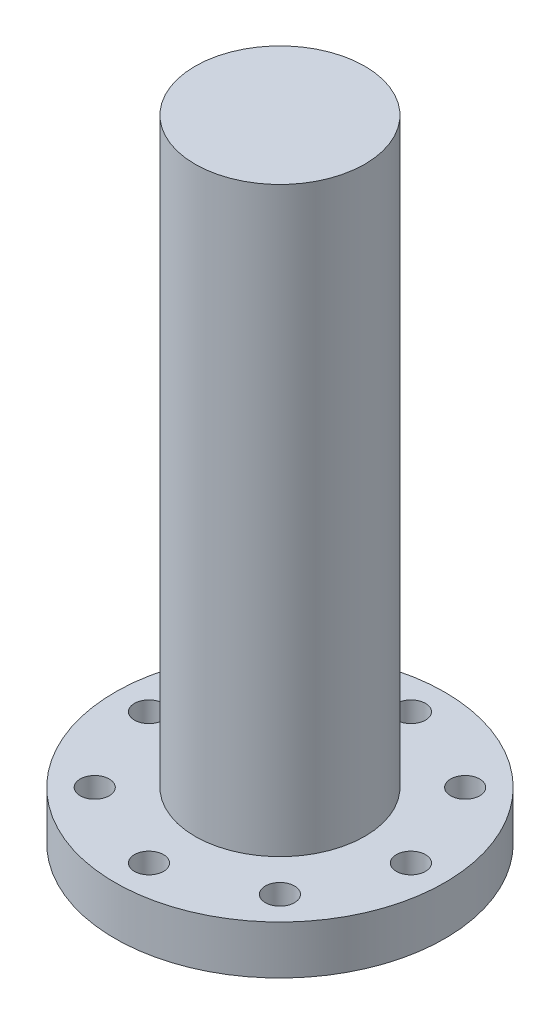
ISO-10303-21;
HEADER;
FILE_DESCRIPTION(('STEP AP214'),'2;1');
FILE_NAME('part.step','',(''),(''),'','','');
FILE_SCHEMA(('AUTOMOTIVE_DESIGN { 1 0 10303 214 1 1 1 1 }'));
ENDSEC;
DATA;
#1=APPLICATION_CONTEXT('core data for automotive mechanical design processes');
#2=APPLICATION_PROTOCOL_DEFINITION('international standard','automotive_design',2000,#1);
#3=PRODUCT_CONTEXT('',#1,'mechanical');
#4=PRODUCT('Part','Part','',(#3));
#5=PRODUCT_RELATED_PRODUCT_CATEGORY('part','',(#4));
#6=PRODUCT_DEFINITION_FORMATION('','',#4);
#7=PRODUCT_DEFINITION_CONTEXT('part definition',#1,'design');
#8=PRODUCT_DEFINITION('design','',#6,#7);
#9=PRODUCT_DEFINITION_SHAPE('','',#8);
#10=(LENGTH_UNIT() NAMED_UNIT(*) SI_UNIT(.MILLI.,.METRE.));
#11=(NAMED_UNIT(*) PLANE_ANGLE_UNIT() SI_UNIT($,.RADIAN.));
#12=(NAMED_UNIT(*) SI_UNIT($,.STERADIAN.) SOLID_ANGLE_UNIT());
#13=UNCERTAINTY_MEASURE_WITH_UNIT(LENGTH_MEASURE(1.E-05),#10,'distance_accuracy_value','');
#14=(GEOMETRIC_REPRESENTATION_CONTEXT(3) GLOBAL_UNCERTAINTY_ASSIGNED_CONTEXT((#13)) GLOBAL_UNIT_ASSIGNED_CONTEXT((#10,
#11,#12)) REPRESENTATION_CONTEXT('',''));
#15=CARTESIAN_POINT('',(0.,0.,0.));
#16=DIRECTION('',(0.,0.,1.));
#17=DIRECTION('',(1.,0.,0.));
#18=AXIS2_PLACEMENT_3D('',#15,#16,#17);
#19=CARTESIAN_POINT('',(0.,0.,0.));
#20=DIRECTION('',(0.,-1.,0.));
#21=DIRECTION('',(0.,0.,-1.));
#22=AXIS2_PLACEMENT_3D('',#19,#20,#21);
#23=PLANE('',#22);
#24=CARTESIAN_POINT('',(27.0000000000011,0.,1.14611941239482E-12));
#25=DIRECTION('',(0.,-1.,0.));
#26=DIRECTION('',(0.,0.,-1.));
#27=AXIS2_PLACEMENT_3D('',#24,#25,#26);
#28=CIRCLE('',#27,3.00000000000085);
#29=CARTESIAN_POINT('',(27.0000000000011,0.,-2.9999999999997));
#30=VERTEX_POINT('',#29);
#31=EDGE_CURVE('E51',#30,#30,#28,.T.);
#32=ORIENTED_EDGE('',*,*,#31,.F.);
#33=EDGE_LOOP('',(#32));
#34=FACE_BOUND('',#33,.T.);
#35=CARTESIAN_POINT('',(19.0918830920387,0.,-19.091883092036));
#36=DIRECTION('',(0.,-1.,0.));
#37=DIRECTION('',(0.,0.,-1.));
#38=AXIS2_PLACEMENT_3D('',#35,#36,#37);
#39=CIRCLE('',#38,3.00000000000177);
#40=CARTESIAN_POINT('',(19.0918830920387,0.,-22.0918830920377));
#41=VERTEX_POINT('',#40);
#42=EDGE_CURVE('E97',#41,#41,#39,.T.);
#43=ORIENTED_EDGE('',*,*,#42,.F.);
#44=EDGE_LOOP('',(#43));
#45=FACE_BOUND('',#44,.T.);
#46=CARTESIAN_POINT('',(2.29223882478963E-12,0.,-27.));
#47=DIRECTION('',(0.,-1.,0.));
#48=DIRECTION('',(0.,0.,-1.));
#49=AXIS2_PLACEMENT_3D('',#46,#47,#48);
#50=CIRCLE('',#49,3.00000000000237);
#51=CARTESIAN_POINT('',(2.29223882478963E-12,0.,-30.0000000000024));
#52=VERTEX_POINT('',#51);
#53=EDGE_CURVE('E94',#52,#52,#50,.T.);
#54=ORIENTED_EDGE('',*,*,#53,.F.);
#55=EDGE_LOOP('',(#54));
#56=FACE_BOUND('',#55,.T.);
#57=CARTESIAN_POINT('',(-19.0918830920348,0.,-19.0918830920376));
#58=DIRECTION('',(0.,-1.,0.));
#59=DIRECTION('',(0.,0.,-1.));
#60=AXIS2_PLACEMENT_3D('',#57,#58,#59);
#61=CIRCLE('',#60,3.00000000000233);
#62=CARTESIAN_POINT('',(-19.0918830920348,0.,-22.0918830920399));
#63=VERTEX_POINT('',#62);
#64=EDGE_CURVE('E91',#63,#63,#61,.T.);
#65=ORIENTED_EDGE('',*,*,#64,.F.);
#66=EDGE_LOOP('',(#65));
#67=FACE_BOUND('',#66,.T.);
#68=CARTESIAN_POINT('',(-26.9999999999989,0.,-1.14942595875251E-12));
#69=DIRECTION('',(0.,-1.,0.));
#70=DIRECTION('',(0.,0.,-1.));
#71=AXIS2_PLACEMENT_3D('',#68,#69,#70);
#72=CIRCLE('',#71,3.0000000000017);
#73=CARTESIAN_POINT('',(-26.9999999999989,0.,-3.00000000000285));
#74=VERTEX_POINT('',#73);
#75=EDGE_CURVE('E88',#74,#74,#72,.T.);
#76=ORIENTED_EDGE('',*,*,#75,.F.);
#77=EDGE_LOOP('',(#76));
#78=FACE_BOUND('',#77,.T.);
#79=CARTESIAN_POINT('',(-19.0918830920365,0.,19.091883092036));
#80=DIRECTION('',(0.,-1.,0.));
#81=DIRECTION('',(0.,0.,-1.));
#82=AXIS2_PLACEMENT_3D('',#79,#80,#81);
#83=CIRCLE('',#82,3.00000000000087);
#84=CARTESIAN_POINT('',(-19.0918830920365,0.,16.0918830920351));
#85=VERTEX_POINT('',#84);
#86=EDGE_CURVE('E85',#85,#85,#83,.T.);
#87=ORIENTED_EDGE('',*,*,#86,.F.);
#88=EDGE_LOOP('',(#87));
#89=FACE_BOUND('',#88,.T.);
#90=CARTESIAN_POINT('',(0.,0.,27.));
#91=DIRECTION('',(0.,-1.,0.));
#92=DIRECTION('',(0.,0.,-1.));
#93=AXIS2_PLACEMENT_3D('',#90,#91,#92);
#94=CIRCLE('',#93,3.);
#95=CARTESIAN_POINT('',(0.,0.,24.));
#96=VERTEX_POINT('',#95);
#97=EDGE_CURVE('E82',#96,#96,#94,.T.);
#98=ORIENTED_EDGE('',*,*,#97,.F.);
#99=EDGE_LOOP('',(#98));
#100=FACE_BOUND('',#99,.T.);
#101=CARTESIAN_POINT('',(19.0918830920371,0.,19.0918830920376));
#102=DIRECTION('',(0.,-1.,0.));
#103=DIRECTION('',(0.,0.,-1.));
#104=AXIS2_PLACEMENT_3D('',#101,#102,#103);
#105=CIRCLE('',#104,3.00000000000013);
#106=CARTESIAN_POINT('',(19.0918830920371,0.,16.0918830920375));
#107=VERTEX_POINT('',#106);
#108=EDGE_CURVE('E79',#107,#107,#105,.T.);
#109=ORIENTED_EDGE('',*,*,#108,.F.);
#110=EDGE_LOOP('',(#109));
#111=FACE_BOUND('',#110,.T.);
#112=CARTESIAN_POINT('',(0.,0.,0.));
#113=DIRECTION('',(0.,-1.,0.));
#114=DIRECTION('',(0.,0.,-1.));
#115=AXIS2_PLACEMENT_3D('',#112,#113,#114);
#116=CIRCLE('',#115,34.);
#117=CARTESIAN_POINT('',(0.,0.,-34.));
#118=VERTEX_POINT('',#117);
#119=EDGE_CURVE('E10',#118,#118,#116,.T.);
#120=ORIENTED_EDGE('',*,*,#119,.T.);
#121=EDGE_LOOP('',(#120));
#122=FACE_BOUND('',#121,.T.);
#123=ADVANCED_FACE('F31',(#34,#45,#56,#67,#78,#89,#100,#111,#122),#23,.T.);
#124=CARTESIAN_POINT('',(0.,0.,0.));
#125=DIRECTION('',(0.,-1.,0.));
#126=DIRECTION('',(0.,0.,-1.));
#127=AXIS2_PLACEMENT_3D('',#124,#125,#126);
#128=CYLINDRICAL_SURFACE('',#127,34.);
#129=CARTESIAN_POINT('',(0.,10.,0.));
#130=DIRECTION('',(0.,-1.,0.));
#131=DIRECTION('',(0.,0.,-1.));
#132=AXIS2_PLACEMENT_3D('',#129,#130,#131);
#133=CIRCLE('',#132,34.);
#134=CARTESIAN_POINT('',(0.,10.,-34.));
#135=VERTEX_POINT('',#134);
#136=EDGE_CURVE('E38',#135,#135,#133,.T.);
#137=ORIENTED_EDGE('',*,*,#136,.T.);
#138=EDGE_LOOP('',(#137));
#139=FACE_BOUND('',#138,.T.);
#140=ORIENTED_EDGE('',*,*,#119,.F.);
#141=EDGE_LOOP('',(#140));
#142=FACE_BOUND('',#141,.T.);
#143=ADVANCED_FACE('F107',(#139,#142),#128,.T.);
#144=CARTESIAN_POINT('',(0.,10.,-34.));
#145=DIRECTION('',(0.,1.,0.));
#146=DIRECTION('',(0.,0.,1.));
#147=AXIS2_PLACEMENT_3D('',#144,#145,#146);
#148=PLANE('',#147);
#149=CARTESIAN_POINT('',(27.0000000000011,9.99999999999999,1.14611941239482E-12));
#150=DIRECTION('',(0.,1.,0.));
#151=DIRECTION('',(0.,0.,1.));
#152=AXIS2_PLACEMENT_3D('',#149,#150,#151);
#153=CIRCLE('',#152,3.00000000000085);
#154=CARTESIAN_POINT('',(27.0000000000011,9.99999999999999,3.000000000002));
#155=VERTEX_POINT('',#154);
#156=EDGE_CURVE('E34',#155,#155,#153,.T.);
#157=ORIENTED_EDGE('',*,*,#156,.F.);
#158=EDGE_LOOP('',(#157));
#159=FACE_BOUND('',#158,.T.);
#160=CARTESIAN_POINT('',(19.0918830920387,9.99999999999999,-19.091883092036));
#161=DIRECTION('',(0.,1.,0.));
#162=DIRECTION('',(0.,0.,1.));
#163=AXIS2_PLACEMENT_3D('',#160,#161,#162);
#164=CIRCLE('',#163,3.00000000000177);
#165=CARTESIAN_POINT('',(19.0918830920387,9.99999999999999,-16.0918830920342));
#166=VERTEX_POINT('',#165);
#167=EDGE_CURVE('E65',#166,#166,#164,.T.);
#168=ORIENTED_EDGE('',*,*,#167,.F.);
#169=EDGE_LOOP('',(#168));
#170=FACE_BOUND('',#169,.T.);
#171=CARTESIAN_POINT('',(2.29223882478963E-12,9.99999999999999,-27.));
#172=DIRECTION('',(0.,1.,0.));
#173=DIRECTION('',(0.,0.,1.));
#174=AXIS2_PLACEMENT_3D('',#171,#172,#173);
#175=CIRCLE('',#174,3.00000000000237);
#176=CARTESIAN_POINT('',(2.29223882478963E-12,9.99999999999999,-23.9999999999976));
#177=VERTEX_POINT('',#176);
#178=EDGE_CURVE('E63',#177,#177,#175,.T.);
#179=ORIENTED_EDGE('',*,*,#178,.F.);
#180=EDGE_LOOP('',(#179));
#181=FACE_BOUND('',#180,.T.);
#182=CARTESIAN_POINT('',(-19.0918830920348,9.99999999999999,-19.0918830920376));
#183=DIRECTION('',(0.,1.,0.));
#184=DIRECTION('',(0.,0.,1.));
#185=AXIS2_PLACEMENT_3D('',#182,#183,#184);
#186=CIRCLE('',#185,3.00000000000233);
#187=CARTESIAN_POINT('',(-19.0918830920348,9.99999999999999,-16.0918830920353));
#188=VERTEX_POINT('',#187);
#189=EDGE_CURVE('E60',#188,#188,#186,.T.);
#190=ORIENTED_EDGE('',*,*,#189,.F.);
#191=EDGE_LOOP('',(#190));
#192=FACE_BOUND('',#191,.T.);
#193=CARTESIAN_POINT('',(-26.9999999999989,9.99999999999999,-1.14942595875251E-12));
#194=DIRECTION('',(0.,1.,0.));
#195=DIRECTION('',(0.,0.,1.));
#196=AXIS2_PLACEMENT_3D('',#193,#194,#195);
#197=CIRCLE('',#196,3.0000000000017);
#198=CARTESIAN_POINT('',(-26.9999999999989,9.99999999999999,3.00000000000056));
#199=VERTEX_POINT('',#198);
#200=EDGE_CURVE('E57',#199,#199,#197,.T.);
#201=ORIENTED_EDGE('',*,*,#200,.F.);
#202=EDGE_LOOP('',(#201));
#203=FACE_BOUND('',#202,.T.);
#204=CARTESIAN_POINT('',(-19.0918830920365,9.99999999999999,19.091883092036));
#205=DIRECTION('',(0.,1.,0.));
#206=DIRECTION('',(0.,0.,1.));
#207=AXIS2_PLACEMENT_3D('',#204,#205,#206);
#208=CIRCLE('',#207,3.00000000000087);
#209=CARTESIAN_POINT('',(-19.0918830920365,9.99999999999999,22.0918830920368));
#210=VERTEX_POINT('',#209);
#211=EDGE_CURVE('E54',#210,#210,#208,.T.);
#212=ORIENTED_EDGE('',*,*,#211,.F.);
#213=EDGE_LOOP('',(#212));
#214=FACE_BOUND('',#213,.T.);
#215=CARTESIAN_POINT('',(0.,9.99999999999999,27.));
#216=DIRECTION('',(0.,1.,0.));
#217=DIRECTION('',(0.,0.,1.));
#218=AXIS2_PLACEMENT_3D('',#215,#216,#217);
#219=CIRCLE('',#218,3.);
#220=CARTESIAN_POINT('',(0.,9.99999999999999,30.));
#221=VERTEX_POINT('',#220);
#222=EDGE_CURVE('E50',#221,#221,#219,.T.);
#223=ORIENTED_EDGE('',*,*,#222,.F.);
#224=EDGE_LOOP('',(#223));
#225=FACE_BOUND('',#224,.T.);
#226=CARTESIAN_POINT('',(19.0918830920371,9.99999999999999,19.0918830920376));
#227=DIRECTION('',(0.,1.,0.));
#228=DIRECTION('',(0.,0.,1.));
#229=AXIS2_PLACEMENT_3D('',#226,#227,#228);
#230=CIRCLE('',#229,3.00000000000013);
#231=CARTESIAN_POINT('',(19.0918830920371,9.99999999999999,22.0918830920377));
#232=VERTEX_POINT('',#231);
#233=EDGE_CURVE('E47',#232,#232,#230,.T.);
#234=ORIENTED_EDGE('',*,*,#233,.F.);
#235=EDGE_LOOP('',(#234));
#236=FACE_BOUND('',#235,.T.);
#237=CARTESIAN_POINT('',(0.,10.,0.));
#238=DIRECTION('',(0.,-1.,0.));
#239=DIRECTION('',(0.,0.,-1.));
#240=AXIS2_PLACEMENT_3D('',#237,#238,#239);
#241=CIRCLE('',#240,17.5);
#242=CARTESIAN_POINT('',(0.,10.,-17.5));
#243=VERTEX_POINT('',#242);
#244=EDGE_CURVE('E43',#243,#243,#241,.T.);
#245=ORIENTED_EDGE('',*,*,#244,.T.);
#246=EDGE_LOOP('',(#245));
#247=FACE_BOUND('',#246,.T.);
#248=ORIENTED_EDGE('',*,*,#136,.F.);
#249=EDGE_LOOP('',(#248));
#250=FACE_BOUND('',#249,.T.);
#251=ADVANCED_FACE('F142',(#159,#170,#181,#192,#203,#214,#225,#236,#247,#250),#148,.T.);
#252=CARTESIAN_POINT('',(0.,0.,0.));
#253=DIRECTION('',(0.,-1.,0.));
#254=DIRECTION('',(0.,0.,-1.));
#255=AXIS2_PLACEMENT_3D('',#252,#253,#254);
#256=CYLINDRICAL_SURFACE('',#255,17.5);
#257=CARTESIAN_POINT('',(0.,130.,0.));
#258=DIRECTION('',(0.,-1.,0.));
#259=DIRECTION('',(0.,0.,-1.));
#260=AXIS2_PLACEMENT_3D('',#257,#258,#259);
#261=CIRCLE('',#260,17.5);
#262=CARTESIAN_POINT('',(0.,130.,-17.5));
#263=VERTEX_POINT('',#262);
#264=EDGE_CURVE('E70',#263,#263,#261,.T.);
#265=ORIENTED_EDGE('',*,*,#264,.T.);
#266=EDGE_LOOP('',(#265));
#267=FACE_BOUND('',#266,.T.);
#268=ORIENTED_EDGE('',*,*,#244,.F.);
#269=EDGE_LOOP('',(#268));
#270=FACE_BOUND('',#269,.T.);
#271=ADVANCED_FACE('F135',(#267,#270),#256,.T.);
#272=CARTESIAN_POINT('',(0.,130.,-17.5));
#273=DIRECTION('',(0.,1.,0.));
#274=DIRECTION('',(0.,0.,1.));
#275=AXIS2_PLACEMENT_3D('',#272,#273,#274);
#276=PLANE('',#275);
#277=ORIENTED_EDGE('',*,*,#264,.F.);
#278=EDGE_LOOP('',(#277));
#279=FACE_BOUND('',#278,.T.);
#280=ADVANCED_FACE('F125',(#279),#276,.T.);
#281=CARTESIAN_POINT('',(19.0918830920371,130.,19.0918830920376));
#282=DIRECTION('',(0.,-1.,0.));
#283=DIRECTION('',(0.,0.,-1.));
#284=AXIS2_PLACEMENT_3D('',#281,#282,#283);
#285=CYLINDRICAL_SURFACE('',#284,3.00000000000013);
#286=ORIENTED_EDGE('',*,*,#233,.T.);
#287=EDGE_LOOP('',(#286));
#288=FACE_BOUND('',#287,.T.);
#289=ORIENTED_EDGE('',*,*,#108,.T.);
#290=EDGE_LOOP('',(#289));
#291=FACE_BOUND('',#290,.T.);
#292=ADVANCED_FACE('F122',(#288,#291),#285,.F.);
#293=CARTESIAN_POINT('',(0.,130.,27.));
#294=DIRECTION('',(0.,-1.,0.));
#295=DIRECTION('',(0.,0.,-1.));
#296=AXIS2_PLACEMENT_3D('',#293,#294,#295);
#297=CYLINDRICAL_SURFACE('',#296,3.);
#298=ORIENTED_EDGE('',*,*,#222,.T.);
#299=EDGE_LOOP('',(#298));
#300=FACE_BOUND('',#299,.T.);
#301=ORIENTED_EDGE('',*,*,#97,.T.);
#302=EDGE_LOOP('',(#301));
#303=FACE_BOUND('',#302,.T.);
#304=ADVANCED_FACE('F124',(#300,#303),#297,.F.);
#305=CARTESIAN_POINT('',(-19.0918830920365,130.,19.091883092036));
#306=DIRECTION('',(0.,-1.,0.));
#307=DIRECTION('',(0.,0.,-1.));
#308=AXIS2_PLACEMENT_3D('',#305,#306,#307);
#309=CYLINDRICAL_SURFACE('',#308,3.00000000000087);
#310=ORIENTED_EDGE('',*,*,#211,.T.);
#311=EDGE_LOOP('',(#310));
#312=FACE_BOUND('',#311,.T.);
#313=ORIENTED_EDGE('',*,*,#86,.T.);
#314=EDGE_LOOP('',(#313));
#315=FACE_BOUND('',#314,.T.);
#316=ADVANCED_FACE('F132',(#312,#315),#309,.F.);
#317=CARTESIAN_POINT('',(-26.9999999999989,130.,-1.14942595875251E-12));
#318=DIRECTION('',(0.,-1.,0.));
#319=DIRECTION('',(0.,0.,-1.));
#320=AXIS2_PLACEMENT_3D('',#317,#318,#319);
#321=CYLINDRICAL_SURFACE('',#320,3.0000000000017);
#322=ORIENTED_EDGE('',*,*,#200,.T.);
#323=EDGE_LOOP('',(#322));
#324=FACE_BOUND('',#323,.T.);
#325=ORIENTED_EDGE('',*,*,#75,.T.);
#326=EDGE_LOOP('',(#325));
#327=FACE_BOUND('',#326,.T.);
#328=ADVANCED_FACE('F195',(#324,#327),#321,.F.);
#329=CARTESIAN_POINT('',(-19.0918830920348,130.,-19.0918830920376));
#330=DIRECTION('',(0.,-1.,0.));
#331=DIRECTION('',(0.,0.,-1.));
#332=AXIS2_PLACEMENT_3D('',#329,#330,#331);
#333=CYLINDRICAL_SURFACE('',#332,3.00000000000233);
#334=ORIENTED_EDGE('',*,*,#189,.T.);
#335=EDGE_LOOP('',(#334));
#336=FACE_BOUND('',#335,.T.);
#337=ORIENTED_EDGE('',*,*,#64,.T.);
#338=EDGE_LOOP('',(#337));
#339=FACE_BOUND('',#338,.T.);
#340=ADVANCED_FACE('F203',(#336,#339),#333,.F.);
#341=CARTESIAN_POINT('',(2.29223882478963E-12,130.,-27.));
#342=DIRECTION('',(0.,-1.,0.));
#343=DIRECTION('',(0.,0.,-1.));
#344=AXIS2_PLACEMENT_3D('',#341,#342,#343);
#345=CYLINDRICAL_SURFACE('',#344,3.00000000000237);
#346=ORIENTED_EDGE('',*,*,#178,.T.);
#347=EDGE_LOOP('',(#346));
#348=FACE_BOUND('',#347,.T.);
#349=ORIENTED_EDGE('',*,*,#53,.T.);
#350=EDGE_LOOP('',(#349));
#351=FACE_BOUND('',#350,.T.);
#352=ADVANCED_FACE('F212',(#348,#351),#345,.F.);
#353=CARTESIAN_POINT('',(19.0918830920387,130.,-19.091883092036));
#354=DIRECTION('',(0.,-1.,0.));
#355=DIRECTION('',(0.,0.,-1.));
#356=AXIS2_PLACEMENT_3D('',#353,#354,#355);
#357=CYLINDRICAL_SURFACE('',#356,3.00000000000177);
#358=ORIENTED_EDGE('',*,*,#167,.T.);
#359=EDGE_LOOP('',(#358));
#360=FACE_BOUND('',#359,.T.);
#361=ORIENTED_EDGE('',*,*,#42,.T.);
#362=EDGE_LOOP('',(#361));
#363=FACE_BOUND('',#362,.T.);
#364=ADVANCED_FACE('F221',(#360,#363),#357,.F.);
#365=CARTESIAN_POINT('',(27.0000000000011,130.,1.14611941239482E-12));
#366=DIRECTION('',(0.,-1.,0.));
#367=DIRECTION('',(0.,0.,-1.));
#368=AXIS2_PLACEMENT_3D('',#365,#366,#367);
#369=CYLINDRICAL_SURFACE('',#368,3.00000000000085);
#370=ORIENTED_EDGE('',*,*,#156,.T.);
#371=EDGE_LOOP('',(#370));
#372=FACE_BOUND('',#371,.T.);
#373=ORIENTED_EDGE('',*,*,#31,.T.);
#374=EDGE_LOOP('',(#373));
#375=FACE_BOUND('',#374,.T.);
#376=ADVANCED_FACE('F103',(#372,#375),#369,.F.);
#377=CLOSED_SHELL('',(#123,#143,#251,#271,#280,#292,#304,#316,#328,#340,#352,#364,#376));
#378=MANIFOLD_SOLID_BREP('B2',#377);
#379=ADVANCED_BREP_SHAPE_REPRESENTATION('',(#18,#378),#14);
#380=SHAPE_DEFINITION_REPRESENTATION(#9,#379);
ENDSEC;
END-ISO-10303-21;
